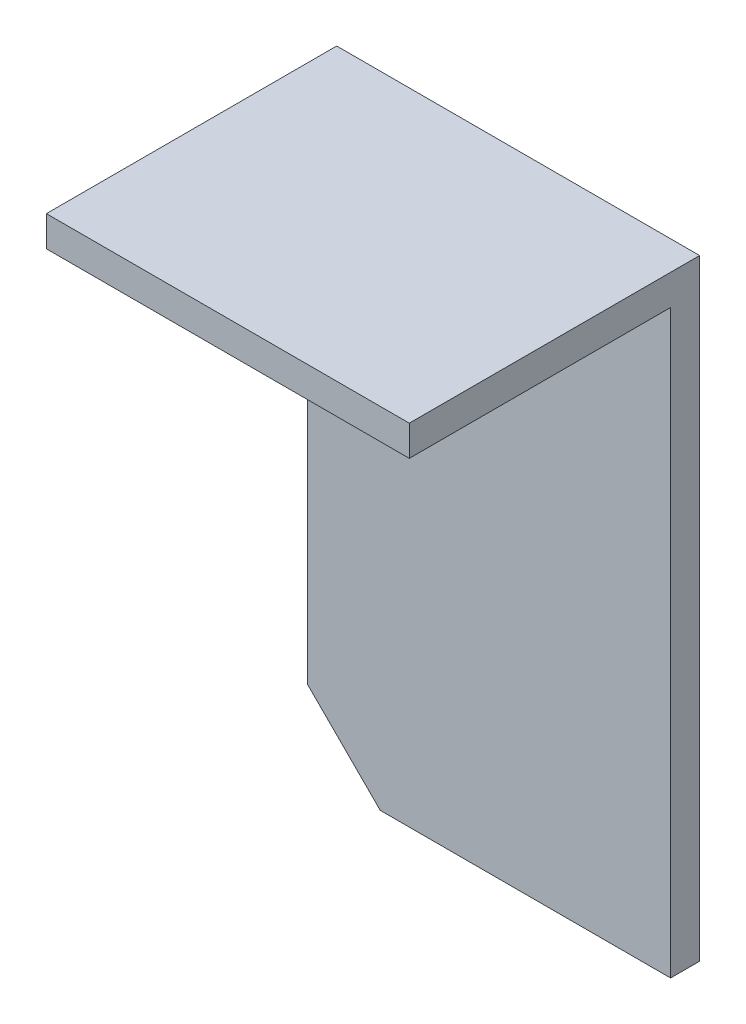
ISO-10303-21;
HEADER;
FILE_DESCRIPTION(('STEP AP214'),'2;1');
FILE_NAME('part.step','',(''),(''),'','','');
FILE_SCHEMA(('AUTOMOTIVE_DESIGN { 1 0 10303 214 1 1 1 1 }'));
ENDSEC;
DATA;
#1=APPLICATION_CONTEXT('core data for automotive mechanical design processes');
#2=APPLICATION_PROTOCOL_DEFINITION('international standard','automotive_design',2000,#1);
#3=PRODUCT_CONTEXT('',#1,'mechanical');
#4=PRODUCT('Part','Part','',(#3));
#5=PRODUCT_RELATED_PRODUCT_CATEGORY('part','',(#4));
#6=PRODUCT_DEFINITION_FORMATION('','',#4);
#7=PRODUCT_DEFINITION_CONTEXT('part definition',#1,'design');
#8=PRODUCT_DEFINITION('design','',#6,#7);
#9=PRODUCT_DEFINITION_SHAPE('','',#8);
#10=(LENGTH_UNIT() NAMED_UNIT(*) SI_UNIT(.MILLI.,.METRE.));
#11=(NAMED_UNIT(*) PLANE_ANGLE_UNIT() SI_UNIT($,.RADIAN.));
#12=(NAMED_UNIT(*) SI_UNIT($,.STERADIAN.) SOLID_ANGLE_UNIT());
#13=UNCERTAINTY_MEASURE_WITH_UNIT(LENGTH_MEASURE(1.E-05),#10,'distance_accuracy_value','');
#14=(GEOMETRIC_REPRESENTATION_CONTEXT(3) GLOBAL_UNCERTAINTY_ASSIGNED_CONTEXT((#13)) GLOBAL_UNIT_ASSIGNED_CONTEXT((#10,
#11,#12)) REPRESENTATION_CONTEXT('',''));
#15=CARTESIAN_POINT('',(0.,0.,0.));
#16=DIRECTION('',(0.,0.,1.));
#17=DIRECTION('',(1.,0.,0.));
#18=AXIS2_PLACEMENT_3D('',#15,#16,#17);
#19=CARTESIAN_POINT('',(-0.778320699595439,1.5105,0.2));
#20=DIRECTION('',(0.,0.,1.));
#21=DIRECTION('',(0.,-1.,0.));
#22=AXIS2_PLACEMENT_3D('',#19,#20,#21);
#23=PLANE('',#22);
#24=DIRECTION('',(1.,0.,0.));
#25=VECTOR('',#24,1.);
#26=CARTESIAN_POINT('',(-0.778320699595439,1.521,0.2));
#27=LINE('',#26,#25);
#28=CARTESIAN_POINT('',(-0.903320699595438,1.521,0.2));
#29=VERTEX_POINT('',#28);
#30=CARTESIAN_POINT('',(-0.653320699595441,1.521,0.2));
#31=VERTEX_POINT('',#30);
#32=EDGE_CURVE('E129',#29,#31,#27,.T.);
#33=ORIENTED_EDGE('',*,*,#32,.F.);
#34=DIRECTION('',(0.,-1.,0.));
#35=VECTOR('',#34,1.);
#36=CARTESIAN_POINT('',(-0.90332069959544,1.39066637478108,0.2));
#37=LINE('',#36,#35);
#38=CARTESIAN_POINT('',(-0.903320699595438,1.5,0.2));
#39=VERTEX_POINT('',#38);
#40=EDGE_CURVE('E152',#29,#39,#37,.T.);
#41=ORIENTED_EDGE('',*,*,#40,.T.);
#42=DIRECTION('',(1.,0.,0.));
#43=VECTOR('',#42,1.);
#44=CARTESIAN_POINT('',(-0.778320699595439,1.5,0.2));
#45=LINE('',#44,#43);
#46=CARTESIAN_POINT('',(-0.653320699595441,1.5,0.2));
#47=VERTEX_POINT('',#46);
#48=EDGE_CURVE('E11',#39,#47,#45,.T.);
#49=ORIENTED_EDGE('',*,*,#48,.T.);
#50=DIRECTION('',(0.,-1.,0.));
#51=VECTOR('',#50,1.);
#52=CARTESIAN_POINT('',(-0.653320699595439,1.36847101449275,0.2));
#53=LINE('',#52,#51);
#54=EDGE_CURVE('E79',#31,#47,#53,.T.);
#55=ORIENTED_EDGE('',*,*,#54,.F.);
#56=EDGE_LOOP('',(#33,#41,#49,#55));
#57=FACE_BOUND('',#56,.T.);
#58=ADVANCED_FACE('F17',(#57),#23,.T.);
#59=CARTESIAN_POINT('',(-0.778320699595439,1.5,0.11));
#60=DIRECTION('',(0.,1.,0.));
#61=DIRECTION('',(1.,0.,0.));
#62=AXIS2_PLACEMENT_3D('',#59,#60,#61);
#63=PLANE('',#62);
#64=DIRECTION('',(0.,0.,-1.));
#65=VECTOR('',#64,1.);
#66=CARTESIAN_POINT('',(-0.903320699595439,1.5,0.0448336252189131));
#67=LINE('',#66,#65);
#68=CARTESIAN_POINT('',(-0.903320699595438,1.5,0.02));
#69=VERTEX_POINT('',#68);
#70=EDGE_CURVE('E149',#39,#69,#67,.T.);
#71=ORIENTED_EDGE('',*,*,#70,.T.);
#72=DIRECTION('',(-1.,0.,0.));
#73=VECTOR('',#72,1.);
#74=CARTESIAN_POINT('',(-0.775032042106293,1.5,0.02));
#75=LINE('',#74,#73);
#76=CARTESIAN_POINT('',(-0.65332069959544,1.5,0.02));
#77=VERTEX_POINT('',#76);
#78=EDGE_CURVE('E21',#77,#69,#75,.T.);
#79=ORIENTED_EDGE('',*,*,#78,.F.);
#80=DIRECTION('',(0.,0.,-1.));
#81=VECTOR('',#80,1.);
#82=CARTESIAN_POINT('',(-0.653320699595439,1.5,0.0420289855072454));
#83=LINE('',#82,#81);
#84=EDGE_CURVE('E175',#47,#77,#83,.T.);
#85=ORIENTED_EDGE('',*,*,#84,.F.);
#86=ORIENTED_EDGE('',*,*,#48,.F.);
#87=EDGE_LOOP('',(#71,#79,#85,#86));
#88=FACE_BOUND('',#87,.T.);
#89=ADVANCED_FACE('F19',(#88),#63,.F.);
#90=CARTESIAN_POINT('',(-0.775032042106293,1.30501737448108,0.02));
#91=DIRECTION('',(0.,0.,1.));
#92=DIRECTION('',(0.,-1.,0.));
#93=AXIS2_PLACEMENT_3D('',#90,#91,#92);
#94=PLANE('',#93);
#95=DIRECTION('',(1.,0.,0.));
#96=VECTOR('',#95,1.);
#97=CARTESIAN_POINT('',(-0.75332069959544,1.1,0.02));
#98=LINE('',#97,#96);
#99=CARTESIAN_POINT('',(-0.853320699595439,1.1,0.02));
#100=VERTEX_POINT('',#99);
#101=CARTESIAN_POINT('',(-0.653320699595438,1.1,0.02));
#102=VERTEX_POINT('',#101);
#103=EDGE_CURVE('E168',#100,#102,#98,.T.);
#104=ORIENTED_EDGE('',*,*,#103,.T.);
#105=DIRECTION('',(0.,-1.,0.));
#106=VECTOR('',#105,1.);
#107=CARTESIAN_POINT('',(-0.653320699595439,1.36847101449275,0.02));
#108=LINE('',#107,#106);
#109=EDGE_CURVE('E169',#77,#102,#108,.T.);
#110=ORIENTED_EDGE('',*,*,#109,.F.);
#111=ORIENTED_EDGE('',*,*,#78,.T.);
#112=DIRECTION('',(0.,-1.,0.));
#113=VECTOR('',#112,1.);
#114=CARTESIAN_POINT('',(-0.903320699595439,1.39066637478108,0.02));
#115=LINE('',#114,#113);
#116=CARTESIAN_POINT('',(-0.903320699595439,1.15,0.02));
#117=VERTEX_POINT('',#116);
#118=EDGE_CURVE('E153',#69,#117,#115,.T.);
#119=ORIENTED_EDGE('',*,*,#118,.T.);
#120=DIRECTION('',(0.70710678118654,-0.707106781186555,0.));
#121=VECTOR('',#120,1.);
#122=CARTESIAN_POINT('',(-0.878320699595438,1.125,0.02));
#123=LINE('',#122,#121);
#124=EDGE_CURVE('E41',#117,#100,#123,.T.);
#125=ORIENTED_EDGE('',*,*,#124,.T.);
#126=EDGE_LOOP('',(#104,#110,#111,#119,#125));
#127=FACE_BOUND('',#126,.T.);
#128=ADVANCED_FACE('F195',(#127),#94,.T.);
#129=CARTESIAN_POINT('',(-0.878320699595438,1.125,0.01));
#130=DIRECTION('',(0.707106781186555,0.70710678118654,0.));
#131=DIRECTION('',(0.,0.,-1.));
#132=AXIS2_PLACEMENT_3D('',#129,#130,#131);
#133=PLANE('',#132);
#134=DIRECTION('',(0.,0.,1.));
#135=VECTOR('',#134,1.);
#136=CARTESIAN_POINT('',(-0.853320699595439,1.1,0.01));
#137=LINE('',#136,#135);
#138=CARTESIAN_POINT('',(-0.853320699595439,1.1,0.));
#139=VERTEX_POINT('',#138);
#140=EDGE_CURVE('E93',#139,#100,#137,.T.);
#141=ORIENTED_EDGE('',*,*,#140,.T.);
#142=ORIENTED_EDGE('',*,*,#124,.F.);
#143=DIRECTION('',(0.,0.,-1.));
#144=VECTOR('',#143,1.);
#145=CARTESIAN_POINT('',(-0.90332069959544,1.15,0.0448336252189131));
#146=LINE('',#145,#144);
#147=CARTESIAN_POINT('',(-0.903320699595439,1.15,0.));
#148=VERTEX_POINT('',#147);
#149=EDGE_CURVE('E172',#117,#148,#146,.T.);
#150=ORIENTED_EDGE('',*,*,#149,.T.);
#151=DIRECTION('',(0.707106781186544,-0.707106781186551,0.));
#152=VECTOR('',#151,1.);
#153=CARTESIAN_POINT('',(-0.903320699595439,1.15,0.));
#154=LINE('',#153,#152);
#155=EDGE_CURVE('E157',#148,#139,#154,.T.);
#156=ORIENTED_EDGE('',*,*,#155,.T.);
#157=EDGE_LOOP('',(#141,#142,#150,#156));
#158=FACE_BOUND('',#157,.T.);
#159=ADVANCED_FACE('F202',(#158),#133,.F.);
#160=CARTESIAN_POINT('',(-0.75332069959544,1.1,0.01));
#161=DIRECTION('',(0.,1.,0.));
#162=DIRECTION('',(1.,0.,0.));
#163=AXIS2_PLACEMENT_3D('',#160,#161,#162);
#164=PLANE('',#163);
#165=DIRECTION('',(0.,0.,-1.));
#166=VECTOR('',#165,1.);
#167=CARTESIAN_POINT('',(-0.653320699595438,1.1,0.0420289855072454));
#168=LINE('',#167,#166);
#169=CARTESIAN_POINT('',(-0.653320699595438,1.1,0.));
#170=VERTEX_POINT('',#169);
#171=EDGE_CURVE('E105',#102,#170,#168,.T.);
#172=ORIENTED_EDGE('',*,*,#171,.F.);
#173=ORIENTED_EDGE('',*,*,#103,.F.);
#174=ORIENTED_EDGE('',*,*,#140,.F.);
#175=DIRECTION('',(1.,0.,0.));
#176=VECTOR('',#175,1.);
#177=CARTESIAN_POINT('',(-0.775137262256358,1.1,0.));
#178=LINE('',#177,#176);
#179=EDGE_CURVE('E138',#139,#170,#178,.T.);
#180=ORIENTED_EDGE('',*,*,#179,.T.);
#181=EDGE_LOOP('',(#172,#173,#174,#180));
#182=FACE_BOUND('',#181,.T.);
#183=ADVANCED_FACE('F203',(#182),#164,.F.);
#184=CARTESIAN_POINT('',(-0.653320699595439,1.36847101449275,0.0420289855072454));
#185=DIRECTION('',(1.,0.,0.));
#186=DIRECTION('',(0.,1.,0.));
#187=AXIS2_PLACEMENT_3D('',#184,#185,#186);
#188=PLANE('',#187);
#189=DIRECTION('',(0.,0.,-1.));
#190=VECTOR('',#189,1.);
#191=CARTESIAN_POINT('',(-0.653320699595441,1.521,0.0999999999999988));
#192=LINE('',#191,#190);
#193=CARTESIAN_POINT('',(-0.65332069959544,1.521,0.));
#194=VERTEX_POINT('',#193);
#195=EDGE_CURVE('E125',#31,#194,#192,.T.);
#196=ORIENTED_EDGE('',*,*,#195,.F.);
#197=ORIENTED_EDGE('',*,*,#54,.T.);
#198=ORIENTED_EDGE('',*,*,#84,.T.);
#199=ORIENTED_EDGE('',*,*,#109,.T.);
#200=ORIENTED_EDGE('',*,*,#171,.T.);
#201=DIRECTION('',(0.,1.,0.));
#202=VECTOR('',#201,1.);
#203=CARTESIAN_POINT('',(-0.653320699595439,1.31559112123515,0.));
#204=LINE('',#203,#202);
#205=EDGE_CURVE('E133',#170,#194,#204,.T.);
#206=ORIENTED_EDGE('',*,*,#205,.T.);
#207=EDGE_LOOP('',(#196,#197,#198,#199,#200,#206));
#208=FACE_BOUND('',#207,.T.);
#209=ADVANCED_FACE('F134',(#208),#188,.T.);
#210=CARTESIAN_POINT('',(-0.778320699595439,1.521,0.0999999999999988));
#211=DIRECTION('',(0.,1.,0.));
#212=DIRECTION('',(1.,0.,0.));
#213=AXIS2_PLACEMENT_3D('',#210,#211,#212);
#214=PLANE('',#213);
#215=ORIENTED_EDGE('',*,*,#32,.T.);
#216=ORIENTED_EDGE('',*,*,#195,.T.);
#217=DIRECTION('',(-1.,0.,0.));
#218=VECTOR('',#217,1.);
#219=CARTESIAN_POINT('',(-0.775137262256358,1.521,0.));
#220=LINE('',#219,#218);
#221=CARTESIAN_POINT('',(-0.903320699595438,1.521,0.));
#222=VERTEX_POINT('',#221);
#223=EDGE_CURVE('E128',#194,#222,#220,.T.);
#224=ORIENTED_EDGE('',*,*,#223,.T.);
#225=DIRECTION('',(0.,0.,1.));
#226=VECTOR('',#225,1.);
#227=CARTESIAN_POINT('',(-0.903320699595439,1.521,0.0448336252189131));
#228=LINE('',#227,#226);
#229=EDGE_CURVE('E115',#222,#29,#228,.T.);
#230=ORIENTED_EDGE('',*,*,#229,.T.);
#231=EDGE_LOOP('',(#215,#216,#224,#230));
#232=FACE_BOUND('',#231,.T.);
#233=ADVANCED_FACE('F126',(#232),#214,.T.);
#234=CARTESIAN_POINT('',(-0.903320699595439,1.39066637478108,0.0448336252189131));
#235=DIRECTION('',(1.,0.,0.));
#236=DIRECTION('',(0.,0.,1.));
#237=AXIS2_PLACEMENT_3D('',#234,#235,#236);
#238=PLANE('',#237);
#239=ORIENTED_EDGE('',*,*,#118,.F.);
#240=ORIENTED_EDGE('',*,*,#70,.F.);
#241=ORIENTED_EDGE('',*,*,#40,.F.);
#242=ORIENTED_EDGE('',*,*,#229,.F.);
#243=DIRECTION('',(0.,-1.,0.));
#244=VECTOR('',#243,1.);
#245=CARTESIAN_POINT('',(-0.903320699595438,1.31559112123515,0.));
#246=LINE('',#245,#244);
#247=EDGE_CURVE('E142',#222,#148,#246,.T.);
#248=ORIENTED_EDGE('',*,*,#247,.T.);
#249=ORIENTED_EDGE('',*,*,#149,.F.);
#250=EDGE_LOOP('',(#239,#240,#241,#242,#248,#249));
#251=FACE_BOUND('',#250,.T.);
#252=ADVANCED_FACE('F200',(#251),#238,.F.);
#253=CARTESIAN_POINT('',(-0.775137262256358,1.31559112123515,0.));
#254=DIRECTION('',(0.,0.,1.));
#255=DIRECTION('',(0.,-1.,0.));
#256=AXIS2_PLACEMENT_3D('',#253,#254,#255);
#257=PLANE('',#256);
#258=ORIENTED_EDGE('',*,*,#223,.F.);
#259=ORIENTED_EDGE('',*,*,#205,.F.);
#260=ORIENTED_EDGE('',*,*,#179,.F.);
#261=ORIENTED_EDGE('',*,*,#155,.F.);
#262=ORIENTED_EDGE('',*,*,#247,.F.);
#263=EDGE_LOOP('',(#258,#259,#260,#261,#262));
#264=FACE_BOUND('',#263,.T.);
#265=ADVANCED_FACE('F140',(#264),#257,.F.);
#266=CLOSED_SHELL('',(#58,#89,#128,#159,#183,#209,#233,#252,#265));
#267=MANIFOLD_SOLID_BREP('B1',#266);
#268=ADVANCED_BREP_SHAPE_REPRESENTATION('',(#18,#267),#14);
#269=SHAPE_DEFINITION_REPRESENTATION(#9,#268);
ENDSEC;
END-ISO-10303-21;
